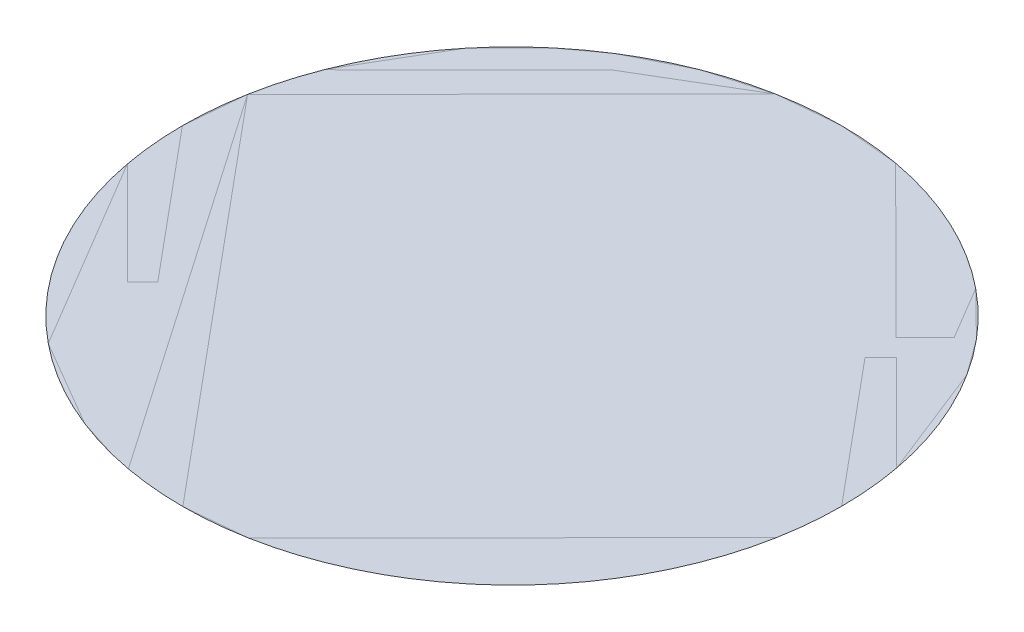
ISO-10303-21;
HEADER;
FILE_DESCRIPTION(('STEP AP214'),'2;1');
FILE_NAME('part.step','',(''),(''),'','','');
FILE_SCHEMA(('AUTOMOTIVE_DESIGN { 1 0 10303 214 1 1 1 1 }'));
ENDSEC;
DATA;
#1=APPLICATION_CONTEXT('core data for automotive mechanical design processes');
#2=APPLICATION_PROTOCOL_DEFINITION('international standard','automotive_design',2000,#1);
#3=PRODUCT_CONTEXT('',#1,'mechanical');
#4=PRODUCT('Part','Part','',(#3));
#5=PRODUCT_RELATED_PRODUCT_CATEGORY('part','',(#4));
#6=PRODUCT_DEFINITION_FORMATION('','',#4);
#7=PRODUCT_DEFINITION_CONTEXT('part definition',#1,'design');
#8=PRODUCT_DEFINITION('design','',#6,#7);
#9=PRODUCT_DEFINITION_SHAPE('','',#8);
#10=(LENGTH_UNIT() NAMED_UNIT(*) SI_UNIT(.MILLI.,.METRE.));
#11=(NAMED_UNIT(*) PLANE_ANGLE_UNIT() SI_UNIT($,.RADIAN.));
#12=(NAMED_UNIT(*) SI_UNIT($,.STERADIAN.) SOLID_ANGLE_UNIT());
#13=UNCERTAINTY_MEASURE_WITH_UNIT(LENGTH_MEASURE(1.E-05),#10,'distance_accuracy_value','');
#14=(GEOMETRIC_REPRESENTATION_CONTEXT(3) GLOBAL_UNCERTAINTY_ASSIGNED_CONTEXT((#13)) GLOBAL_UNIT_ASSIGNED_CONTEXT((#10,
#11,#12)) REPRESENTATION_CONTEXT('',''));
#15=CARTESIAN_POINT('',(0.,0.,0.));
#16=DIRECTION('',(0.,0.,1.));
#17=DIRECTION('',(1.,0.,0.));
#18=AXIS2_PLACEMENT_3D('',#15,#16,#17);
#19=CARTESIAN_POINT('',(-131.998718137117,4889.108717628,-699.260009999996));
#20=DIRECTION('',(0.,1.,0.));
#21=DIRECTION('',(0.,0.,1.));
#22=AXIS2_PLACEMENT_3D('',#19,#20,#21);
#23=PLANE('',#22);
#24=CARTESIAN_POINT('',(64.6052579973211,4889.108617628,-699.260009999996));
#25=CARTESIAN_POINT('',(64.6052093408482,4889.108617628,-693.332651181969));
#26=CARTESIAN_POINT('',(63.5266970167037,4889.108617628,-687.504240052929));
#27=CARTESIAN_POINT('',(62.3830822061772,4889.108617628,-681.324007208308));
#28=CARTESIAN_POINT('',(60.0692130730292,4889.108617628,-675.479156321302));
#29=CARTESIAN_POINT('',(58.8765110077243,4889.108617628,-672.466381906162));
#30=CARTESIAN_POINT('',(57.3878174361304,4889.108617628,-669.587164318839));
#31=CARTESIAN_POINT('',(55.8760435518018,4889.108617628,-666.663308100963));
#32=CARTESIAN_POINT('',(54.0743109448807,4889.108617628,-663.907382703899));
#33=CARTESIAN_POINT('',(52.253946259218,4889.108617628,-661.122957728813));
#34=CARTESIAN_POINT('',(50.1564979803155,4889.108617628,-658.539436928746));
#35=CARTESIAN_POINT('',(48.0484818146228,4889.108617628,-655.94289919014));
#36=CARTESIAN_POINT('',(45.6828160302123,4889.108617628,-653.577193969784));
#37=CARTESIAN_POINT('',(43.3179107522491,4889.108617628,-651.212249268553));
#38=CARTESIAN_POINT('',(40.7205730712505,4889.108617628,-649.103512019681));
#39=CARTESIAN_POINT('',(38.1379176798462,4889.108617628,-647.006695088753));
#40=CARTESIAN_POINT('',(35.3526272960978,4889.108617628,-645.185699055115));
#41=CARTESIAN_POINT('',(32.5976175998181,4889.108617628,-643.384500243376));
#42=CARTESIAN_POINT('',(29.6728456811579,4889.108617628,-641.872192563866));
#43=CARTESIAN_POINT('',(26.7945779950335,4889.108617628,-640.383930762103));
#44=CARTESIAN_POINT('',(23.780853678694,4889.108617628,-639.190796926967));
#45=CARTESIAN_POINT('',(17.9370116856306,4889.108617628,-636.877219148367));
#46=CARTESIAN_POINT('',(11.755769947067,4889.108617628,-635.733312983292));
#47=CARTESIAN_POINT('',(5.92789212593339,4889.108617628,-634.654800663138));
#48=CARTESIAN_POINT('',(0.,4889.108617628,-634.654752002675));
#49=CARTESIAN_POINT('',(-5.92683295757029,4889.108617628,-634.654703350907));
#50=CARTESIAN_POINT('',(-11.7557699470664,4889.108617628,-635.733312983292));
#51=CARTESIAN_POINT('',(-17.9360027967337,4889.108617628,-636.876927795745));
#52=CARTESIAN_POINT('',(-23.7808536786936,4889.108617628,-639.190796926967));
#53=CARTESIAN_POINT('',(-26.7936280906972,4889.108617628,-640.383498991067));
#54=CARTESIAN_POINT('',(-29.6728456811575,4889.108617628,-641.872192563866));
#55=CARTESIAN_POINT('',(-32.5967018956936,4889.108617628,-643.383966446044));
#56=CARTESIAN_POINT('',(-35.3526272960974,4889.108617628,-645.185699055115));
#57=CARTESIAN_POINT('',(-38.1370522793927,4889.108617628,-647.006063746112));
#58=CARTESIAN_POINT('',(-40.7205730712503,4889.108617628,-649.103512019681));
#59=CARTESIAN_POINT('',(-43.3171108191453,4889.108617628,-651.211528194253));
#60=CARTESIAN_POINT('',(-45.6828160302121,4889.108617628,-653.577193969784));
#61=CARTESIAN_POINT('',(-48.0477607362823,4889.108617628,-655.942099252996));
#62=CARTESIAN_POINT('',(-50.1564979803153,4889.108617628,-658.539436928746));
#63=CARTESIAN_POINT('',(-52.2533149150924,4889.108617628,-661.122092325599));
#64=CARTESIAN_POINT('',(-54.0743109448806,4889.108617628,-663.907382703898));
#65=CARTESIAN_POINT('',(-55.8755097557371,4889.108617628,-666.662392399261));
#66=CARTESIAN_POINT('',(-57.3878174361303,4889.108617628,-669.587164318838));
#67=CARTESIAN_POINT('',(-58.876079234395,4889.108617628,-672.465431997418));
#68=CARTESIAN_POINT('',(-60.0692130730291,4889.108617628,-675.479156321302));
#69=CARTESIAN_POINT('',(-62.382790849649,4889.108617628,-681.322998306857));
#70=CARTESIAN_POINT('',(-63.5266970167036,4889.108617628,-687.504240052929));
#71=CARTESIAN_POINT('',(-64.6052093363928,4889.108617628,-693.332117868538));
#72=CARTESIAN_POINT('',(-64.6052579973211,4889.108617628,-699.260009999996));
#73=B_SPLINE_CURVE_WITH_KNOTS('',2,(#24,#25,#26,#27,#28,#29,#30,#31,#32,#33,#34,#35,#36,#37,#38,
#39,#40,#41,#42,#43,#44,#45,#46,#47,#48,#49,#50,#51,#52,#53,#54,#55,#56,#57,#58,#59,#60,#61,#62,
#63,#64,#65,#66,#67,#68,#69,#70,#71,#72),.UNSPECIFIED.,.F.,.F.,(3,2,2,2,2,2,2,2,2,2,2,2,2,2,2,2,
2,2,2,2,2,2,2,2,3),(0.,0.0625,0.125,0.15625,0.1875,0.21875,0.25,0.28125,0.3125,0.34375,0.375,
0.4375,0.5,0.5625,0.625,0.65625,0.6875,0.71875,0.75,0.78125,0.8125,0.84375,0.875,0.9375,1.),.UNSPECIFIED.);
#74=CARTESIAN_POINT('',(64.6052559930519,4889.108667628,-699.260009999996));
#75=VERTEX_POINT('',#74);
#76=CARTESIAN_POINT('',(-64.6052559930519,4889.108667628,-699.260009999996));
#77=VERTEX_POINT('',#76);
#78=EDGE_CURVE('E27',#75,#77,#73,.T.);
#79=ORIENTED_EDGE('',*,*,#78,.F.);
#80=CARTESIAN_POINT('',(-64.6052579973211,4889.108617628,-699.260009999996));
#81=CARTESIAN_POINT('',(-64.6052093408482,4889.108617628,-705.18736882031));
#82=CARTESIAN_POINT('',(-63.5266970167037,4889.108617628,-711.015779947063));
#83=CARTESIAN_POINT('',(-62.3830822051864,4889.108617628,-717.196012794614));
#84=CARTESIAN_POINT('',(-60.0692130730292,4889.108617628,-723.04086367869));
#85=CARTESIAN_POINT('',(-58.8765110083689,4889.108617628,-726.053638091981));
#86=CARTESIAN_POINT('',(-57.3878174361304,4889.108617628,-728.932855681154));
#87=CARTESIAN_POINT('',(-55.876043553512,4889.108617628,-731.856711896332));
#88=CARTESIAN_POINT('',(-54.0743109448807,4889.108617628,-734.612637296094));
#89=CARTESIAN_POINT('',(-52.2539462553163,4889.108617628,-737.397062277229));
#90=CARTESIAN_POINT('',(-50.1564979803154,4889.108617628,-739.980583071246));
#91=CARTESIAN_POINT('',(-48.0484818067174,4889.108617628,-742.57712081834));
#92=CARTESIAN_POINT('',(-45.6828160302123,4889.108617628,-744.942826030208));
#93=CARTESIAN_POINT('',(-43.3179107445469,4889.108617628,-747.307770738559));
#94=CARTESIAN_POINT('',(-40.7205730712504,4889.108617628,-749.416507980311));
#95=CARTESIAN_POINT('',(-38.1379176755997,4889.108617628,-751.513324913825));
#96=CARTESIAN_POINT('',(-35.3526272960977,4889.108617628,-753.334320944877));
#97=CARTESIAN_POINT('',(-32.5976176035774,4889.108617628,-755.135519754347));
#98=CARTESIAN_POINT('',(-29.6728456811578,4889.108617628,-756.647827436126));
#99=CARTESIAN_POINT('',(-26.7945780005859,4889.108617628,-758.136089235338));
#100=CARTESIAN_POINT('',(-23.7808536786938,4889.108617628,-759.329223073025));
#101=CARTESIAN_POINT('',(-17.9370116857465,4889.108617628,-761.642800852263));
#102=CARTESIAN_POINT('',(-11.7557699470667,4889.108617628,-762.786707016699));
#103=CARTESIAN_POINT('',(-5.92789212927691,4889.108617628,-763.865219335613));
#104=CARTESIAN_POINT('',(0.,4889.108617628,-763.865267997317));
#105=CARTESIAN_POINT('',(5.92683294417056,4889.108617628,-763.865316650326));
#106=CARTESIAN_POINT('',(11.7557699470667,4889.108617628,-762.7867070167));
#107=CARTESIAN_POINT('',(17.9360027808859,4889.108617628,-761.643092208494));
#108=CARTESIAN_POINT('',(23.7808536786937,4889.108617628,-759.329223073025));
#109=CARTESIAN_POINT('',(26.7936280764245,4889.108617628,-758.136521015621));
#110=CARTESIAN_POINT('',(29.6728456811577,4889.108617628,-756.647827436126));
#111=CARTESIAN_POINT('',(32.5967018905069,4889.108617628,-755.136053557325));
#112=CARTESIAN_POINT('',(35.3526272960976,4889.108617628,-753.334320944877));
#113=CARTESIAN_POINT('',(38.1370522750618,4889.108617628,-751.513956256726));
#114=CARTESIAN_POINT('',(40.7205730712504,4889.108617628,-749.416507980311));
#115=CARTESIAN_POINT('',(43.31711081373,4889.108617628,-747.30849181081));
#116=CARTESIAN_POINT('',(45.6828160302122,4889.108617628,-744.942826030208));
#117=CARTESIAN_POINT('',(48.0477607318095,4889.108617628,-742.577920751814));
#118=CARTESIAN_POINT('',(50.1564979803154,4889.108617628,-739.980583071246));
#119=CARTESIAN_POINT('',(52.2533149117301,4889.108617628,-737.397927679223));
#120=CARTESIAN_POINT('',(54.0743109448806,4889.108617628,-734.612637296094));
#121=CARTESIAN_POINT('',(55.875509755622,4889.108617628,-731.857627601217));
#122=CARTESIAN_POINT('',(57.3878174361303,4889.108617628,-728.932855681154));
#123=CARTESIAN_POINT('',(58.8760792352363,4889.108617628,-726.054588000687));
#124=CARTESIAN_POINT('',(60.0692130730292,4889.108617628,-723.04086367869));
#125=CARTESIAN_POINT('',(62.3827908507267,4889.108617628,-717.19702168995));
#126=CARTESIAN_POINT('',(63.5266970167037,4889.108617628,-711.015779947063));
#127=CARTESIAN_POINT('',(64.6052093363929,4889.108617628,-705.187902128966));
#128=CARTESIAN_POINT('',(64.6052579973211,4889.108617628,-699.260009999996));
#129=B_SPLINE_CURVE_WITH_KNOTS('',2,(#80,#81,#82,#83,#84,#85,#86,#87,#88,#89,#90,#91,#92,#93,
#94,#95,#96,#97,#98,#99,#100,#101,#102,#103,#104,#105,#106,#107,#108,#109,#110,#111,#112,#113,
#114,#115,#116,#117,#118,#119,#120,#121,#122,#123,#124,#125,#126,#127,#128),.UNSPECIFIED.,.F.,
.F.,(3,2,2,2,2,2,2,2,2,2,2,2,2,2,2,2,2,2,2,2,2,2,2,2,3),(0.,0.0625,0.125,0.15625,0.1875,0.21875,
0.25,0.28125,0.3125,0.34375,0.375,0.4375,0.5,0.5625,0.625,0.65625,0.6875,0.71875,0.75,0.78125,
0.8125,0.84375,0.875,0.9375,1.),.UNSPECIFIED.);
#130=EDGE_CURVE('E10',#77,#75,#129,.T.);
#131=ORIENTED_EDGE('',*,*,#130,.F.);
#132=EDGE_LOOP('',(#79,#131));
#133=FACE_BOUND('',#132,.T.);
#134=ADVANCED_FACE('F15',(#133),#23,.T.);
#135=CARTESIAN_POINT('',(0.,4889.108617628,-567.261283685461));
#136=DIRECTION('',(0.,-1.,0.));
#137=DIRECTION('',(0.,0.,-1.));
#138=AXIS2_PLACEMENT_3D('',#135,#136,#137);
#139=PLANE('',#138);
#140=ORIENTED_EDGE('',*,*,#78,.T.);
#141=ORIENTED_EDGE('',*,*,#130,.T.);
#142=EDGE_LOOP('',(#140,#141));
#143=FACE_BOUND('',#142,.T.);
#144=ADVANCED_FACE('F17',(#143),#139,.T.);
#145=CLOSED_SHELL('',(#134,#144));
#146=MANIFOLD_SOLID_BREP('B1',#145);
#147=ADVANCED_BREP_SHAPE_REPRESENTATION('',(#18,#146),#14);
#148=SHAPE_DEFINITION_REPRESENTATION(#9,#147);
ENDSEC;
END-ISO-10303-21;
